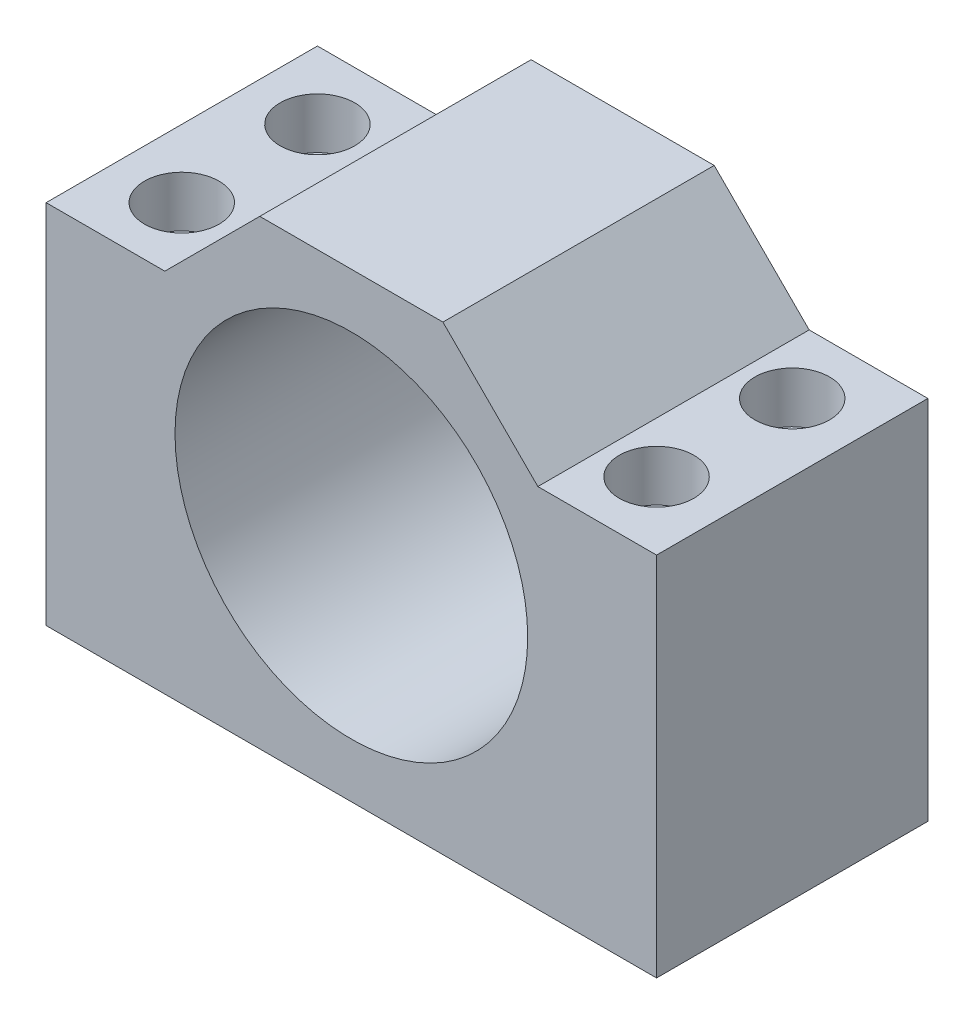
ISO-10303-21;
HEADER;
FILE_DESCRIPTION(('STEP AP214'),'2;1');
FILE_NAME('part.step','',(''),(''),'','','');
FILE_SCHEMA(('AUTOMOTIVE_DESIGN { 1 0 10303 214 1 1 1 1 }'));
ENDSEC;
DATA;
#1=APPLICATION_CONTEXT('core data for automotive mechanical design processes');
#2=APPLICATION_PROTOCOL_DEFINITION('international standard','automotive_design',2000,#1);
#3=PRODUCT_CONTEXT('',#1,'mechanical');
#4=PRODUCT('Part','Part','',(#3));
#5=PRODUCT_RELATED_PRODUCT_CATEGORY('part','',(#4));
#6=PRODUCT_DEFINITION_FORMATION('','',#4);
#7=PRODUCT_DEFINITION_CONTEXT('part definition',#1,'design');
#8=PRODUCT_DEFINITION('design','',#6,#7);
#9=PRODUCT_DEFINITION_SHAPE('','',#8);
#10=(LENGTH_UNIT() NAMED_UNIT(*) SI_UNIT(.MILLI.,.METRE.));
#11=(NAMED_UNIT(*) PLANE_ANGLE_UNIT() SI_UNIT($,.RADIAN.));
#12=(NAMED_UNIT(*) SI_UNIT($,.STERADIAN.) SOLID_ANGLE_UNIT());
#13=UNCERTAINTY_MEASURE_WITH_UNIT(LENGTH_MEASURE(1.E-05),#10,'distance_accuracy_value','');
#14=(GEOMETRIC_REPRESENTATION_CONTEXT(3) GLOBAL_UNCERTAINTY_ASSIGNED_CONTEXT((#13)) GLOBAL_UNIT_ASSIGNED_CONTEXT((#10,
#11,#12)) REPRESENTATION_CONTEXT('',''));
#15=CARTESIAN_POINT('',(0.,0.,0.));
#16=DIRECTION('',(0.,0.,1.));
#17=DIRECTION('',(1.,0.,0.));
#18=AXIS2_PLACEMENT_3D('',#15,#16,#17);
#19=CARTESIAN_POINT('',(0.,9.90924026484686,40.));
#20=DIRECTION('',(0.,-1.,0.));
#21=DIRECTION('',(0.,0.,-1.));
#22=AXIS2_PLACEMENT_3D('',#19,#20,#21);
#23=PLANE('',#22);
#24=CARTESIAN_POINT('',(13.8657265223078,9.90924026484686,10.));
#25=DIRECTION('',(0.,1.,0.));
#26=DIRECTION('',(0.,0.,1.));
#27=AXIS2_PLACEMENT_3D('',#24,#25,#26);
#28=CIRCLE('',#27,5.5);
#29=CARTESIAN_POINT('',(13.8657265223078,9.90924026484686,15.5));
#30=VERTEX_POINT('',#29);
#31=EDGE_CURVE('E227',#30,#30,#28,.T.);
#32=ORIENTED_EDGE('',*,*,#31,.F.);
#33=EDGE_LOOP('',(#32));
#34=FACE_BOUND('',#33,.T.);
#35=CARTESIAN_POINT('',(13.8657265223078,9.90924026484686,30.));
#36=DIRECTION('',(0.,1.,0.));
#37=DIRECTION('',(0.,0.,1.));
#38=AXIS2_PLACEMENT_3D('',#35,#36,#37);
#39=CIRCLE('',#38,5.5);
#40=CARTESIAN_POINT('',(13.8657265223078,9.90924026484686,35.5));
#41=VERTEX_POINT('',#40);
#42=EDGE_CURVE('E215',#41,#41,#39,.T.);
#43=ORIENTED_EDGE('',*,*,#42,.F.);
#44=EDGE_LOOP('',(#43));
#45=FACE_BOUND('',#44,.T.);
#46=DIRECTION('',(-1.,0.,0.));
#47=VECTOR('',#46,1.);
#48=CARTESIAN_POINT('',(0.,9.90924026484686,0.));
#49=LINE('',#48,#47);
#50=CARTESIAN_POINT('',(21.3657265223078,9.90924026484686,0.));
#51=VERTEX_POINT('',#50);
#52=CARTESIAN_POINT('',(3.86572652230782,9.90924026484686,0.));
#53=VERTEX_POINT('',#52);
#54=EDGE_CURVE('E132',#51,#53,#49,.T.);
#55=ORIENTED_EDGE('',*,*,#54,.T.);
#56=DIRECTION('',(0.,0.,-1.));
#57=VECTOR('',#56,1.);
#58=CARTESIAN_POINT('',(3.86572652230782,9.90924026484686,40.));
#59=LINE('',#58,#57);
#60=CARTESIAN_POINT('',(3.86572652230782,9.90924026484686,40.));
#61=VERTEX_POINT('',#60);
#62=EDGE_CURVE('E11',#61,#53,#59,.T.);
#63=ORIENTED_EDGE('',*,*,#62,.F.);
#64=DIRECTION('',(-1.,0.,0.));
#65=VECTOR('',#64,1.);
#66=CARTESIAN_POINT('',(0.,9.90924026484686,40.));
#67=LINE('',#66,#65);
#68=CARTESIAN_POINT('',(21.3657265223078,9.90924026484686,40.));
#69=VERTEX_POINT('',#68);
#70=EDGE_CURVE('E179',#69,#61,#67,.T.);
#71=ORIENTED_EDGE('',*,*,#70,.F.);
#72=DIRECTION('',(0.,0.,-1.));
#73=VECTOR('',#72,1.);
#74=CARTESIAN_POINT('',(21.3657265223078,9.90924026484686,40.));
#75=LINE('',#74,#73);
#76=EDGE_CURVE('E125',#69,#51,#75,.T.);
#77=ORIENTED_EDGE('',*,*,#76,.T.);
#78=EDGE_LOOP('',(#55,#63,#71,#77));
#79=FACE_BOUND('',#78,.T.);
#80=ADVANCED_FACE('F32',(#34,#45,#79),#23,.F.);
#81=CARTESIAN_POINT('',(3.86572652230783,0.,40.));
#82=DIRECTION('',(1.,0.,0.));
#83=DIRECTION('',(0.,1.,0.));
#84=AXIS2_PLACEMENT_3D('',#81,#82,#83);
#85=PLANE('',#84);
#86=DIRECTION('',(0.,-1.,0.));
#87=VECTOR('',#86,1.);
#88=CARTESIAN_POINT('',(3.86572652230783,0.,0.));
#89=LINE('',#88,#87);
#90=CARTESIAN_POINT('',(3.86572652230784,-44.0907597351531,0.));
#91=VERTEX_POINT('',#90);
#92=EDGE_CURVE('E136',#53,#91,#89,.T.);
#93=ORIENTED_EDGE('',*,*,#92,.T.);
#94=DIRECTION('',(0.,0.,-1.));
#95=VECTOR('',#94,1.);
#96=CARTESIAN_POINT('',(3.86572652230784,-44.0907597351531,40.));
#97=LINE('',#96,#95);
#98=CARTESIAN_POINT('',(3.86572652230784,-44.0907597351531,40.));
#99=VERTEX_POINT('',#98);
#100=EDGE_CURVE('E41',#99,#91,#97,.T.);
#101=ORIENTED_EDGE('',*,*,#100,.F.);
#102=DIRECTION('',(0.,-1.,0.));
#103=VECTOR('',#102,1.);
#104=CARTESIAN_POINT('',(3.86572652230783,0.,40.));
#105=LINE('',#104,#103);
#106=EDGE_CURVE('E92',#61,#99,#105,.T.);
#107=ORIENTED_EDGE('',*,*,#106,.F.);
#108=ORIENTED_EDGE('',*,*,#62,.T.);
#109=EDGE_LOOP('',(#93,#101,#107,#108));
#110=FACE_BOUND('',#109,.T.);
#111=ADVANCED_FACE('F235',(#110),#85,.F.);
#112=CARTESIAN_POINT('',(0.,-44.0907597351531,40.));
#113=DIRECTION('',(0.,1.,0.));
#114=DIRECTION('',(0.,0.,1.));
#115=AXIS2_PLACEMENT_3D('',#112,#113,#114);
#116=PLANE('',#115);
#117=CARTESIAN_POINT('',(13.8657265223078,-44.0907597351531,10.));
#118=DIRECTION('',(0.,1.,0.));
#119=DIRECTION('',(0.,0.,1.));
#120=AXIS2_PLACEMENT_3D('',#117,#118,#119);
#121=CIRCLE('',#120,3.29999999999999);
#122=CARTESIAN_POINT('',(13.8657265223078,-44.0907597351531,13.3));
#123=VERTEX_POINT('',#122);
#124=EDGE_CURVE('E218',#123,#123,#121,.T.);
#125=ORIENTED_EDGE('',*,*,#124,.T.);
#126=EDGE_LOOP('',(#125));
#127=FACE_BOUND('',#126,.T.);
#128=CARTESIAN_POINT('',(13.8657265223078,-44.0907597351531,30.));
#129=DIRECTION('',(0.,1.,0.));
#130=DIRECTION('',(0.,0.,1.));
#131=AXIS2_PLACEMENT_3D('',#128,#129,#130);
#132=CIRCLE('',#131,3.29999999999999);
#133=CARTESIAN_POINT('',(13.8657265223078,-44.0907597351531,33.3));
#134=VERTEX_POINT('',#133);
#135=EDGE_CURVE('E206',#134,#134,#132,.T.);
#136=ORIENTED_EDGE('',*,*,#135,.T.);
#137=EDGE_LOOP('',(#136));
#138=FACE_BOUND('',#137,.T.);
#139=CARTESIAN_POINT('',(83.8657265223078,-44.0907597351531,10.));
#140=DIRECTION('',(0.,1.,0.));
#141=DIRECTION('',(0.,0.,1.));
#142=AXIS2_PLACEMENT_3D('',#139,#140,#141);
#143=CIRCLE('',#142,3.29999999999998);
#144=CARTESIAN_POINT('',(83.8657265223078,-44.0907597351531,13.3));
#145=VERTEX_POINT('',#144);
#146=EDGE_CURVE('E194',#145,#145,#143,.T.);
#147=ORIENTED_EDGE('',*,*,#146,.T.);
#148=EDGE_LOOP('',(#147));
#149=FACE_BOUND('',#148,.T.);
#150=CARTESIAN_POINT('',(83.8657265223078,-44.0907597351531,30.));
#151=DIRECTION('',(0.,1.,0.));
#152=DIRECTION('',(0.,0.,1.));
#153=AXIS2_PLACEMENT_3D('',#150,#151,#152);
#154=CIRCLE('',#153,3.29999999999998);
#155=CARTESIAN_POINT('',(83.8657265223078,-44.0907597351531,33.3));
#156=VERTEX_POINT('',#155);
#157=EDGE_CURVE('E133',#156,#156,#154,.T.);
#158=ORIENTED_EDGE('',*,*,#157,.T.);
#159=EDGE_LOOP('',(#158));
#160=FACE_BOUND('',#159,.T.);
#161=DIRECTION('',(1.,0.,0.));
#162=VECTOR('',#161,1.);
#163=CARTESIAN_POINT('',(0.,-44.0907597351531,0.));
#164=LINE('',#163,#162);
#165=CARTESIAN_POINT('',(93.8657265223079,-44.0907597351531,0.));
#166=VERTEX_POINT('',#165);
#167=EDGE_CURVE('E138',#91,#166,#164,.T.);
#168=ORIENTED_EDGE('',*,*,#167,.T.);
#169=DIRECTION('',(0.,0.,-1.));
#170=VECTOR('',#169,1.);
#171=CARTESIAN_POINT('',(93.8657265223079,-44.0907597351531,40.));
#172=LINE('',#171,#170);
#173=CARTESIAN_POINT('',(93.8657265223079,-44.0907597351531,40.));
#174=VERTEX_POINT('',#173);
#175=EDGE_CURVE('E154',#174,#166,#172,.T.);
#176=ORIENTED_EDGE('',*,*,#175,.F.);
#177=DIRECTION('',(1.,0.,0.));
#178=VECTOR('',#177,1.);
#179=CARTESIAN_POINT('',(0.,-44.0907597351531,40.));
#180=LINE('',#179,#178);
#181=EDGE_CURVE('E162',#99,#174,#180,.T.);
#182=ORIENTED_EDGE('',*,*,#181,.F.);
#183=ORIENTED_EDGE('',*,*,#100,.T.);
#184=EDGE_LOOP('',(#168,#176,#182,#183));
#185=FACE_BOUND('',#184,.T.);
#186=ADVANCED_FACE('F160',(#127,#138,#149,#160,#185),#116,.F.);
#187=CARTESIAN_POINT('',(93.8657265223078,0.,40.));
#188=DIRECTION('',(-1.,0.,0.));
#189=DIRECTION('',(0.,-1.,0.));
#190=AXIS2_PLACEMENT_3D('',#187,#188,#189);
#191=PLANE('',#190);
#192=DIRECTION('',(0.,1.,0.));
#193=VECTOR('',#192,1.);
#194=CARTESIAN_POINT('',(93.8657265223078,0.,0.));
#195=LINE('',#194,#193);
#196=CARTESIAN_POINT('',(93.8657265223078,9.90924026484686,0.));
#197=VERTEX_POINT('',#196);
#198=EDGE_CURVE('E140',#166,#197,#195,.T.);
#199=ORIENTED_EDGE('',*,*,#198,.T.);
#200=DIRECTION('',(0.,0.,-1.));
#201=VECTOR('',#200,1.);
#202=CARTESIAN_POINT('',(93.8657265223078,9.90924026484686,40.));
#203=LINE('',#202,#201);
#204=CARTESIAN_POINT('',(93.8657265223078,9.90924026484686,40.));
#205=VERTEX_POINT('',#204);
#206=EDGE_CURVE('E151',#205,#197,#203,.T.);
#207=ORIENTED_EDGE('',*,*,#206,.F.);
#208=DIRECTION('',(0.,1.,0.));
#209=VECTOR('',#208,1.);
#210=CARTESIAN_POINT('',(93.8657265223078,0.,40.));
#211=LINE('',#210,#209);
#212=EDGE_CURVE('E174',#174,#205,#211,.T.);
#213=ORIENTED_EDGE('',*,*,#212,.F.);
#214=ORIENTED_EDGE('',*,*,#175,.T.);
#215=EDGE_LOOP('',(#199,#207,#213,#214));
#216=FACE_BOUND('',#215,.T.);
#217=ADVANCED_FACE('F170',(#216),#191,.F.);
#218=CARTESIAN_POINT('',(0.,9.90924026484684,40.));
#219=DIRECTION('',(0.,-1.,0.));
#220=DIRECTION('',(1.,0.,0.));
#221=AXIS2_PLACEMENT_3D('',#218,#219,#220);
#222=PLANE('',#221);
#223=CARTESIAN_POINT('',(83.8657265223078,9.90924026484686,10.));
#224=DIRECTION('',(0.,1.,0.));
#225=DIRECTION('',(0.,0.,1.));
#226=AXIS2_PLACEMENT_3D('',#223,#224,#225);
#227=CIRCLE('',#226,5.50000000000001);
#228=CARTESIAN_POINT('',(83.8657265223078,9.90924026484686,15.5));
#229=VERTEX_POINT('',#228);
#230=EDGE_CURVE('E203',#229,#229,#227,.T.);
#231=ORIENTED_EDGE('',*,*,#230,.F.);
#232=EDGE_LOOP('',(#231));
#233=FACE_BOUND('',#232,.T.);
#234=CARTESIAN_POINT('',(83.8657265223078,9.90924026484686,30.));
#235=DIRECTION('',(0.,1.,0.));
#236=DIRECTION('',(0.,0.,1.));
#237=AXIS2_PLACEMENT_3D('',#234,#235,#236);
#238=CIRCLE('',#237,5.50000000000001);
#239=CARTESIAN_POINT('',(83.8657265223078,9.90924026484686,35.5));
#240=VERTEX_POINT('',#239);
#241=EDGE_CURVE('E191',#240,#240,#238,.T.);
#242=ORIENTED_EDGE('',*,*,#241,.F.);
#243=EDGE_LOOP('',(#242));
#244=FACE_BOUND('',#243,.T.);
#245=DIRECTION('',(-1.,0.,0.));
#246=VECTOR('',#245,1.);
#247=CARTESIAN_POINT('',(0.,9.90924026484684,0.));
#248=LINE('',#247,#246);
#249=CARTESIAN_POINT('',(76.3657265223078,9.90924026484686,0.));
#250=VERTEX_POINT('',#249);
#251=EDGE_CURVE('E142',#197,#250,#248,.T.);
#252=ORIENTED_EDGE('',*,*,#251,.T.);
#253=DIRECTION('',(0.,0.,-1.));
#254=VECTOR('',#253,1.);
#255=CARTESIAN_POINT('',(76.3657265223078,9.90924026484686,40.));
#256=LINE('',#255,#254);
#257=CARTESIAN_POINT('',(76.3657265223078,9.90924026484686,40.));
#258=VERTEX_POINT('',#257);
#259=EDGE_CURVE('E120',#258,#250,#256,.T.);
#260=ORIENTED_EDGE('',*,*,#259,.F.);
#261=DIRECTION('',(-1.,0.,0.));
#262=VECTOR('',#261,1.);
#263=CARTESIAN_POINT('',(0.,9.90924026484684,40.));
#264=LINE('',#263,#262);
#265=EDGE_CURVE('E111',#205,#258,#264,.T.);
#266=ORIENTED_EDGE('',*,*,#265,.F.);
#267=ORIENTED_EDGE('',*,*,#206,.T.);
#268=EDGE_LOOP('',(#252,#260,#266,#267));
#269=FACE_BOUND('',#268,.T.);
#270=ADVANCED_FACE('F173',(#233,#244,#269),#222,.F.);
#271=CARTESIAN_POINT('',(43.1374833935773,43.1374833935773,40.));
#272=DIRECTION('',(-0.707106781186547,-0.707106781186548,0.));
#273=DIRECTION('',(0.707106781186548,-0.707106781186547,0.));
#274=AXIS2_PLACEMENT_3D('',#271,#272,#273);
#275=PLANE('',#274);
#276=DIRECTION('',(-0.707106781186548,0.707106781186547,0.));
#277=VECTOR('',#276,1.);
#278=CARTESIAN_POINT('',(43.1374833935773,43.1374833935773,0.));
#279=LINE('',#278,#277);
#280=CARTESIAN_POINT('',(62.3657265223078,23.9092402648469,0.));
#281=VERTEX_POINT('',#280);
#282=EDGE_CURVE('E119',#250,#281,#279,.T.);
#283=ORIENTED_EDGE('',*,*,#282,.T.);
#284=DIRECTION('',(0.,0.,-1.));
#285=VECTOR('',#284,1.);
#286=CARTESIAN_POINT('',(62.3657265223078,23.9092402648469,40.));
#287=LINE('',#286,#285);
#288=CARTESIAN_POINT('',(62.3657265223078,23.9092402648469,40.));
#289=VERTEX_POINT('',#288);
#290=EDGE_CURVE('E116',#289,#281,#287,.T.);
#291=ORIENTED_EDGE('',*,*,#290,.F.);
#292=DIRECTION('',(-0.707106781186548,0.707106781186547,0.));
#293=VECTOR('',#292,1.);
#294=CARTESIAN_POINT('',(43.1374833935773,43.1374833935773,40.));
#295=LINE('',#294,#293);
#296=EDGE_CURVE('E105',#258,#289,#295,.T.);
#297=ORIENTED_EDGE('',*,*,#296,.F.);
#298=ORIENTED_EDGE('',*,*,#259,.T.);
#299=EDGE_LOOP('',(#283,#291,#297,#298));
#300=FACE_BOUND('',#299,.T.);
#301=ADVANCED_FACE('F117',(#300),#275,.F.);
#302=CARTESIAN_POINT('',(0.,23.9092402648469,40.));
#303=DIRECTION('',(0.,-1.,0.));
#304=DIRECTION('',(0.,0.,-1.));
#305=AXIS2_PLACEMENT_3D('',#302,#303,#304);
#306=PLANE('',#305);
#307=DIRECTION('',(-1.,0.,0.));
#308=VECTOR('',#307,1.);
#309=CARTESIAN_POINT('',(0.,23.9092402648469,0.));
#310=LINE('',#309,#308);
#311=CARTESIAN_POINT('',(35.3657265223078,23.9092402648469,0.));
#312=VERTEX_POINT('',#311);
#313=EDGE_CURVE('E78',#281,#312,#310,.T.);
#314=ORIENTED_EDGE('',*,*,#313,.T.);
#315=DIRECTION('',(0.,0.,-1.));
#316=VECTOR('',#315,1.);
#317=CARTESIAN_POINT('',(35.3657265223078,23.9092402648469,40.));
#318=LINE('',#317,#316);
#319=CARTESIAN_POINT('',(35.3657265223078,23.9092402648469,40.));
#320=VERTEX_POINT('',#319);
#321=EDGE_CURVE('E121',#320,#312,#318,.T.);
#322=ORIENTED_EDGE('',*,*,#321,.F.);
#323=DIRECTION('',(-1.,0.,0.));
#324=VECTOR('',#323,1.);
#325=CARTESIAN_POINT('',(0.,23.9092402648469,40.));
#326=LINE('',#325,#324);
#327=EDGE_CURVE('E109',#289,#320,#326,.T.);
#328=ORIENTED_EDGE('',*,*,#327,.F.);
#329=ORIENTED_EDGE('',*,*,#290,.T.);
#330=EDGE_LOOP('',(#314,#322,#328,#329));
#331=FACE_BOUND('',#330,.T.);
#332=ADVANCED_FACE('F123',(#331),#306,.F.);
#333=CARTESIAN_POINT('',(48.8657265223078,-10.0907597351531,40.));
#334=DIRECTION('',(0.,0.,-1.));
#335=DIRECTION('',(-1.,0.,0.));
#336=AXIS2_PLACEMENT_3D('',#333,#334,#335);
#337=CYLINDRICAL_SURFACE('',#336,26.);
#338=CARTESIAN_POINT('',(48.8657265223078,-10.0907597351531,40.));
#339=DIRECTION('',(0.,0.,1.));
#340=DIRECTION('',(1.,0.,0.));
#341=AXIS2_PLACEMENT_3D('',#338,#339,#340);
#342=CIRCLE('',#341,26.);
#343=CARTESIAN_POINT('',(74.8657265223078,-10.0907597351531,40.));
#344=VERTEX_POINT('',#343);
#345=EDGE_CURVE('E147',#344,#344,#342,.T.);
#346=ORIENTED_EDGE('',*,*,#345,.T.);
#347=EDGE_LOOP('',(#346));
#348=FACE_BOUND('',#347,.T.);
#349=CARTESIAN_POINT('',(48.8657265223078,-10.0907597351531,0.));
#350=DIRECTION('',(0.,0.,1.));
#351=DIRECTION('',(1.,0.,0.));
#352=AXIS2_PLACEMENT_3D('',#349,#350,#351);
#353=CIRCLE('',#352,26.);
#354=CARTESIAN_POINT('',(74.8657265223078,-10.0907597351531,0.));
#355=VERTEX_POINT('',#354);
#356=EDGE_CURVE('E129',#355,#355,#353,.T.);
#357=ORIENTED_EDGE('',*,*,#356,.F.);
#358=EDGE_LOOP('',(#357));
#359=FACE_BOUND('',#358,.T.);
#360=ADVANCED_FACE('F34',(#348,#359),#337,.F.);
#361=CARTESIAN_POINT('',(5.72824312873049,-5.72824312873049,40.));
#362=DIRECTION('',(0.707106781186548,-0.707106781186547,0.));
#363=DIRECTION('',(0.707106781186547,0.707106781186548,0.));
#364=AXIS2_PLACEMENT_3D('',#361,#362,#363);
#365=PLANE('',#364);
#366=DIRECTION('',(-0.707106781186547,-0.707106781186548,0.));
#367=VECTOR('',#366,1.);
#368=CARTESIAN_POINT('',(5.72824312873049,-5.72824312873049,0.));
#369=LINE('',#368,#367);
#370=EDGE_CURVE('E84',#312,#51,#369,.T.);
#371=ORIENTED_EDGE('',*,*,#370,.T.);
#372=ORIENTED_EDGE('',*,*,#76,.F.);
#373=DIRECTION('',(-0.707106781186547,-0.707106781186548,0.));
#374=VECTOR('',#373,1.);
#375=CARTESIAN_POINT('',(5.72824312873049,-5.72824312873049,40.));
#376=LINE('',#375,#374);
#377=EDGE_CURVE('E49',#320,#69,#376,.T.);
#378=ORIENTED_EDGE('',*,*,#377,.F.);
#379=ORIENTED_EDGE('',*,*,#321,.T.);
#380=EDGE_LOOP('',(#371,#372,#378,#379));
#381=FACE_BOUND('',#380,.T.);
#382=ADVANCED_FACE('F240',(#381),#365,.F.);
#383=CARTESIAN_POINT('',(0.,0.,40.));
#384=DIRECTION('',(0.,0.,1.));
#385=DIRECTION('',(1.,0.,0.));
#386=AXIS2_PLACEMENT_3D('',#383,#384,#385);
#387=PLANE('',#386);
#388=ORIENTED_EDGE('',*,*,#345,.F.);
#389=EDGE_LOOP('',(#388));
#390=FACE_BOUND('',#389,.T.);
#391=ORIENTED_EDGE('',*,*,#70,.T.);
#392=ORIENTED_EDGE('',*,*,#106,.T.);
#393=ORIENTED_EDGE('',*,*,#181,.T.);
#394=ORIENTED_EDGE('',*,*,#212,.T.);
#395=ORIENTED_EDGE('',*,*,#265,.T.);
#396=ORIENTED_EDGE('',*,*,#296,.T.);
#397=ORIENTED_EDGE('',*,*,#327,.T.);
#398=ORIENTED_EDGE('',*,*,#377,.T.);
#399=EDGE_LOOP('',(#391,#392,#393,#394,#395,#396,#397,#398));
#400=FACE_BOUND('',#399,.T.);
#401=ADVANCED_FACE('F107',(#390,#400),#387,.T.);
#402=CARTESIAN_POINT('',(0.,0.,0.));
#403=DIRECTION('',(0.,0.,1.));
#404=DIRECTION('',(1.,0.,0.));
#405=AXIS2_PLACEMENT_3D('',#402,#403,#404);
#406=PLANE('',#405);
#407=ORIENTED_EDGE('',*,*,#356,.T.);
#408=EDGE_LOOP('',(#407));
#409=FACE_BOUND('',#408,.T.);
#410=ORIENTED_EDGE('',*,*,#54,.F.);
#411=ORIENTED_EDGE('',*,*,#370,.F.);
#412=ORIENTED_EDGE('',*,*,#313,.F.);
#413=ORIENTED_EDGE('',*,*,#282,.F.);
#414=ORIENTED_EDGE('',*,*,#251,.F.);
#415=ORIENTED_EDGE('',*,*,#198,.F.);
#416=ORIENTED_EDGE('',*,*,#167,.F.);
#417=ORIENTED_EDGE('',*,*,#92,.F.);
#418=EDGE_LOOP('',(#410,#411,#412,#413,#414,#415,#416,#417));
#419=FACE_BOUND('',#418,.T.);
#420=ADVANCED_FACE('F166',(#409,#419),#406,.F.);
#421=CARTESIAN_POINT('',(83.8657265223078,9.90924026484686,30.));
#422=DIRECTION('',(0.,1.,0.));
#423=DIRECTION('',(0.,0.,1.));
#424=AXIS2_PLACEMENT_3D('',#421,#422,#423);
#425=CYLINDRICAL_SURFACE('',#424,3.29999999999999);
#426=ORIENTED_EDGE('',*,*,#157,.F.);
#427=EDGE_LOOP('',(#426));
#428=FACE_BOUND('',#427,.T.);
#429=CARTESIAN_POINT('',(83.8657265223078,2.40924326484686,30.));
#430=DIRECTION('',(0.,1.,0.));
#431=DIRECTION('',(0.,0.,1.));
#432=AXIS2_PLACEMENT_3D('',#429,#430,#431);
#433=CIRCLE('',#432,3.3);
#434=CARTESIAN_POINT('',(83.8657265223078,2.40924326484686,33.3));
#435=VERTEX_POINT('',#434);
#436=EDGE_CURVE('E185',#435,#435,#433,.T.);
#437=ORIENTED_EDGE('',*,*,#436,.T.);
#438=EDGE_LOOP('',(#437));
#439=FACE_BOUND('',#438,.T.);
#440=ADVANCED_FACE('F312',(#428,#439),#425,.F.);
#441=CARTESIAN_POINT('',(87.1657265223078,2.40924326484686,30.));
#442=DIRECTION('',(0.,-1.,0.));
#443=DIRECTION('',(0.,0.,-1.));
#444=AXIS2_PLACEMENT_3D('',#441,#442,#443);
#445=PLANE('',#444);
#446=ORIENTED_EDGE('',*,*,#436,.F.);
#447=EDGE_LOOP('',(#446));
#448=FACE_BOUND('',#447,.T.);
#449=CARTESIAN_POINT('',(83.8657265223078,2.40924326484686,30.));
#450=DIRECTION('',(0.,1.,0.));
#451=DIRECTION('',(0.,0.,1.));
#452=AXIS2_PLACEMENT_3D('',#449,#450,#451);
#453=CIRCLE('',#452,5.49999999999999);
#454=CARTESIAN_POINT('',(83.8657265223078,2.40924326484686,35.5));
#455=VERTEX_POINT('',#454);
#456=EDGE_CURVE('E188',#455,#455,#453,.T.);
#457=ORIENTED_EDGE('',*,*,#456,.T.);
#458=EDGE_LOOP('',(#457));
#459=FACE_BOUND('',#458,.T.);
#460=ADVANCED_FACE('F337',(#448,#459),#445,.F.);
#461=CARTESIAN_POINT('',(83.8657265223078,9.90924026484686,30.));
#462=DIRECTION('',(0.,1.,0.));
#463=DIRECTION('',(0.,0.,1.));
#464=AXIS2_PLACEMENT_3D('',#461,#462,#463);
#465=CYLINDRICAL_SURFACE('',#464,5.5);
#466=ORIENTED_EDGE('',*,*,#456,.F.);
#467=EDGE_LOOP('',(#466));
#468=FACE_BOUND('',#467,.T.);
#469=ORIENTED_EDGE('',*,*,#241,.T.);
#470=EDGE_LOOP('',(#469));
#471=FACE_BOUND('',#470,.T.);
#472=ADVANCED_FACE('F344',(#468,#471),#465,.F.);
#473=CARTESIAN_POINT('',(83.8657265223078,9.90924026484686,10.));
#474=DIRECTION('',(0.,1.,0.));
#475=DIRECTION('',(0.,0.,1.));
#476=AXIS2_PLACEMENT_3D('',#473,#474,#475);
#477=CYLINDRICAL_SURFACE('',#476,3.29999999999999);
#478=ORIENTED_EDGE('',*,*,#146,.F.);
#479=EDGE_LOOP('',(#478));
#480=FACE_BOUND('',#479,.T.);
#481=CARTESIAN_POINT('',(83.8657265223078,2.40924326484686,10.));
#482=DIRECTION('',(0.,1.,0.));
#483=DIRECTION('',(0.,0.,1.));
#484=AXIS2_PLACEMENT_3D('',#481,#482,#483);
#485=CIRCLE('',#484,3.3);
#486=CARTESIAN_POINT('',(83.8657265223078,2.40924326484686,13.3));
#487=VERTEX_POINT('',#486);
#488=EDGE_CURVE('E197',#487,#487,#485,.T.);
#489=ORIENTED_EDGE('',*,*,#488,.T.);
#490=EDGE_LOOP('',(#489));
#491=FACE_BOUND('',#490,.T.);
#492=ADVANCED_FACE('F352',(#480,#491),#477,.F.);
#493=CARTESIAN_POINT('',(87.1657265223078,2.40924326484686,10.));
#494=DIRECTION('',(0.,-1.,0.));
#495=DIRECTION('',(0.,0.,-1.));
#496=AXIS2_PLACEMENT_3D('',#493,#494,#495);
#497=PLANE('',#496);
#498=ORIENTED_EDGE('',*,*,#488,.F.);
#499=EDGE_LOOP('',(#498));
#500=FACE_BOUND('',#499,.T.);
#501=CARTESIAN_POINT('',(83.8657265223078,2.40924326484686,10.));
#502=DIRECTION('',(0.,1.,0.));
#503=DIRECTION('',(0.,0.,1.));
#504=AXIS2_PLACEMENT_3D('',#501,#502,#503);
#505=CIRCLE('',#504,5.49999999999999);
#506=CARTESIAN_POINT('',(83.8657265223078,2.40924326484686,15.5));
#507=VERTEX_POINT('',#506);
#508=EDGE_CURVE('E200',#507,#507,#505,.T.);
#509=ORIENTED_EDGE('',*,*,#508,.T.);
#510=EDGE_LOOP('',(#509));
#511=FACE_BOUND('',#510,.T.);
#512=ADVANCED_FACE('F360',(#500,#511),#497,.F.);
#513=CARTESIAN_POINT('',(83.8657265223078,9.90924026484686,10.));
#514=DIRECTION('',(0.,1.,0.));
#515=DIRECTION('',(0.,0.,1.));
#516=AXIS2_PLACEMENT_3D('',#513,#514,#515);
#517=CYLINDRICAL_SURFACE('',#516,5.5);
#518=ORIENTED_EDGE('',*,*,#508,.F.);
#519=EDGE_LOOP('',(#518));
#520=FACE_BOUND('',#519,.T.);
#521=ORIENTED_EDGE('',*,*,#230,.T.);
#522=EDGE_LOOP('',(#521));
#523=FACE_BOUND('',#522,.T.);
#524=ADVANCED_FACE('F368',(#520,#523),#517,.F.);
#525=CARTESIAN_POINT('',(13.8657265223078,9.90924026484686,30.));
#526=DIRECTION('',(0.,1.,0.));
#527=DIRECTION('',(0.,0.,1.));
#528=AXIS2_PLACEMENT_3D('',#525,#526,#527);
#529=CYLINDRICAL_SURFACE('',#528,3.3);
#530=ORIENTED_EDGE('',*,*,#135,.F.);
#531=EDGE_LOOP('',(#530));
#532=FACE_BOUND('',#531,.T.);
#533=CARTESIAN_POINT('',(13.8657265223078,2.40924326484686,30.));
#534=DIRECTION('',(0.,1.,0.));
#535=DIRECTION('',(0.,0.,1.));
#536=AXIS2_PLACEMENT_3D('',#533,#534,#535);
#537=CIRCLE('',#536,3.3);
#538=CARTESIAN_POINT('',(13.8657265223078,2.40924326484686,33.3));
#539=VERTEX_POINT('',#538);
#540=EDGE_CURVE('E209',#539,#539,#537,.T.);
#541=ORIENTED_EDGE('',*,*,#540,.T.);
#542=EDGE_LOOP('',(#541));
#543=FACE_BOUND('',#542,.T.);
#544=ADVANCED_FACE('F376',(#532,#543),#529,.F.);
#545=CARTESIAN_POINT('',(17.1657265223078,2.40924326484686,30.));
#546=DIRECTION('',(0.,-1.,0.));
#547=DIRECTION('',(0.,0.,-1.));
#548=AXIS2_PLACEMENT_3D('',#545,#546,#547);
#549=PLANE('',#548);
#550=ORIENTED_EDGE('',*,*,#540,.F.);
#551=EDGE_LOOP('',(#550));
#552=FACE_BOUND('',#551,.T.);
#553=CARTESIAN_POINT('',(13.8657265223078,2.40924326484686,30.));
#554=DIRECTION('',(0.,1.,0.));
#555=DIRECTION('',(0.,0.,1.));
#556=AXIS2_PLACEMENT_3D('',#553,#554,#555);
#557=CIRCLE('',#556,5.5);
#558=CARTESIAN_POINT('',(13.8657265223078,2.40924326484686,35.5));
#559=VERTEX_POINT('',#558);
#560=EDGE_CURVE('E212',#559,#559,#557,.T.);
#561=ORIENTED_EDGE('',*,*,#560,.T.);
#562=EDGE_LOOP('',(#561));
#563=FACE_BOUND('',#562,.T.);
#564=ADVANCED_FACE('F384',(#552,#563),#549,.F.);
#565=CARTESIAN_POINT('',(13.8657265223078,9.90924026484686,30.));
#566=DIRECTION('',(0.,1.,0.));
#567=DIRECTION('',(0.,0.,1.));
#568=AXIS2_PLACEMENT_3D('',#565,#566,#567);
#569=CYLINDRICAL_SURFACE('',#568,5.5);
#570=ORIENTED_EDGE('',*,*,#560,.F.);
#571=EDGE_LOOP('',(#570));
#572=FACE_BOUND('',#571,.T.);
#573=ORIENTED_EDGE('',*,*,#42,.T.);
#574=EDGE_LOOP('',(#573));
#575=FACE_BOUND('',#574,.T.);
#576=ADVANCED_FACE('F392',(#572,#575),#569,.F.);
#577=CARTESIAN_POINT('',(13.8657265223078,9.90924026484686,10.));
#578=DIRECTION('',(0.,1.,0.));
#579=DIRECTION('',(0.,0.,1.));
#580=AXIS2_PLACEMENT_3D('',#577,#578,#579);
#581=CYLINDRICAL_SURFACE('',#580,3.3);
#582=ORIENTED_EDGE('',*,*,#124,.F.);
#583=EDGE_LOOP('',(#582));
#584=FACE_BOUND('',#583,.T.);
#585=CARTESIAN_POINT('',(13.8657265223078,2.40924326484686,10.));
#586=DIRECTION('',(0.,1.,0.));
#587=DIRECTION('',(0.,0.,1.));
#588=AXIS2_PLACEMENT_3D('',#585,#586,#587);
#589=CIRCLE('',#588,3.3);
#590=CARTESIAN_POINT('',(13.8657265223078,2.40924326484686,13.3));
#591=VERTEX_POINT('',#590);
#592=EDGE_CURVE('E221',#591,#591,#589,.T.);
#593=ORIENTED_EDGE('',*,*,#592,.T.);
#594=EDGE_LOOP('',(#593));
#595=FACE_BOUND('',#594,.T.);
#596=ADVANCED_FACE('F400',(#584,#595),#581,.F.);
#597=CARTESIAN_POINT('',(17.1657265223078,2.40924326484686,10.));
#598=DIRECTION('',(0.,-1.,0.));
#599=DIRECTION('',(0.,0.,-1.));
#600=AXIS2_PLACEMENT_3D('',#597,#598,#599);
#601=PLANE('',#600);
#602=ORIENTED_EDGE('',*,*,#592,.F.);
#603=EDGE_LOOP('',(#602));
#604=FACE_BOUND('',#603,.T.);
#605=CARTESIAN_POINT('',(13.8657265223078,2.40924326484686,10.));
#606=DIRECTION('',(0.,1.,0.));
#607=DIRECTION('',(0.,0.,1.));
#608=AXIS2_PLACEMENT_3D('',#605,#606,#607);
#609=CIRCLE('',#608,5.5);
#610=CARTESIAN_POINT('',(13.8657265223078,2.40924326484686,15.5));
#611=VERTEX_POINT('',#610);
#612=EDGE_CURVE('E224',#611,#611,#609,.T.);
#613=ORIENTED_EDGE('',*,*,#612,.T.);
#614=EDGE_LOOP('',(#613));
#615=FACE_BOUND('',#614,.T.);
#616=ADVANCED_FACE('F408',(#604,#615),#601,.F.);
#617=CARTESIAN_POINT('',(13.8657265223078,9.90924026484686,10.));
#618=DIRECTION('',(0.,1.,0.));
#619=DIRECTION('',(0.,0.,1.));
#620=AXIS2_PLACEMENT_3D('',#617,#618,#619);
#621=CYLINDRICAL_SURFACE('',#620,5.5);
#622=ORIENTED_EDGE('',*,*,#612,.F.);
#623=EDGE_LOOP('',(#622));
#624=FACE_BOUND('',#623,.T.);
#625=ORIENTED_EDGE('',*,*,#31,.T.);
#626=EDGE_LOOP('',(#625));
#627=FACE_BOUND('',#626,.T.);
#628=ADVANCED_FACE('F231',(#624,#627),#621,.F.);
#629=CLOSED_SHELL('',(#80,#111,#186,#217,#270,#301,#332,#360,#382,#401,#420,#440,#460,#472,#492,
#512,#524,#544,#564,#576,#596,#616,#628));
#630=MANIFOLD_SOLID_BREP('B2',#629);
#631=ADVANCED_BREP_SHAPE_REPRESENTATION('',(#18,#630),#14);
#632=SHAPE_DEFINITION_REPRESENTATION(#9,#631);
ENDSEC;
END-ISO-10303-21;
